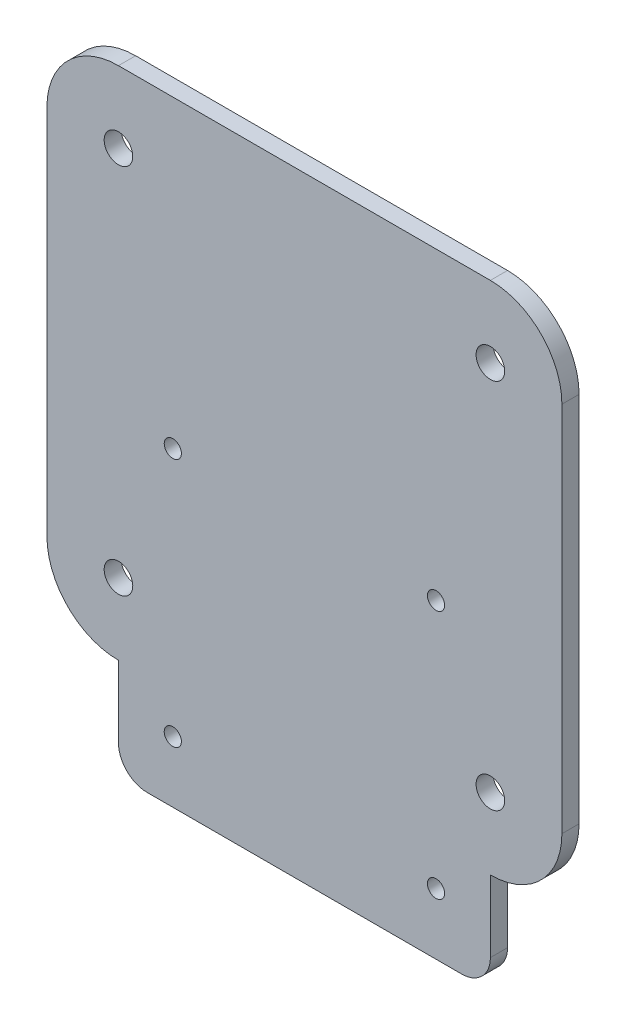
ISO-10303-21;
HEADER;
FILE_DESCRIPTION(('STEP AP214'),'2;1');
FILE_NAME('part.step','',(''),(''),'','','');
FILE_SCHEMA(('AUTOMOTIVE_DESIGN { 1 0 10303 214 1 1 1 1 }'));
ENDSEC;
DATA;
#1=APPLICATION_CONTEXT('core data for automotive mechanical design processes');
#2=APPLICATION_PROTOCOL_DEFINITION('international standard','automotive_design',2000,#1);
#3=PRODUCT_CONTEXT('',#1,'mechanical');
#4=PRODUCT('Part','Part','',(#3));
#5=PRODUCT_RELATED_PRODUCT_CATEGORY('part','',(#4));
#6=PRODUCT_DEFINITION_FORMATION('','',#4);
#7=PRODUCT_DEFINITION_CONTEXT('part definition',#1,'design');
#8=PRODUCT_DEFINITION('design','',#6,#7);
#9=PRODUCT_DEFINITION_SHAPE('','',#8);
#10=(LENGTH_UNIT() NAMED_UNIT(*) SI_UNIT(.MILLI.,.METRE.));
#11=(NAMED_UNIT(*) PLANE_ANGLE_UNIT() SI_UNIT($,.RADIAN.));
#12=(NAMED_UNIT(*) SI_UNIT($,.STERADIAN.) SOLID_ANGLE_UNIT());
#13=UNCERTAINTY_MEASURE_WITH_UNIT(LENGTH_MEASURE(1.E-05),#10,'distance_accuracy_value','');
#14=(GEOMETRIC_REPRESENTATION_CONTEXT(3) GLOBAL_UNCERTAINTY_ASSIGNED_CONTEXT((#13)) GLOBAL_UNIT_ASSIGNED_CONTEXT((#10,
#11,#12)) REPRESENTATION_CONTEXT('',''));
#15=CARTESIAN_POINT('',(0.,0.,0.));
#16=DIRECTION('',(0.,0.,1.));
#17=DIRECTION('',(1.,0.,0.));
#18=AXIS2_PLACEMENT_3D('',#15,#16,#17);
#19=CARTESIAN_POINT('',(27.5,-57.5,3.));
#20=DIRECTION('',(0.,0.,1.));
#21=DIRECTION('',(1.,0.,0.));
#22=AXIS2_PLACEMENT_3D('',#19,#20,#21);
#23=PLANE('',#22);
#24=CARTESIAN_POINT('',(32.4999999999999,-32.5,3.));
#25=DIRECTION('',(0.,0.,1.));
#26=DIRECTION('',(1.,0.,0.));
#27=AXIS2_PLACEMENT_3D('',#24,#25,#26);
#28=CIRCLE('',#27,2.5);
#29=CARTESIAN_POINT('',(34.9999999999999,-32.5,3.));
#30=VERTEX_POINT('',#29);
#31=EDGE_CURVE('E315',#30,#30,#28,.T.);
#32=ORIENTED_EDGE('',*,*,#31,.F.);
#33=EDGE_LOOP('',(#32));
#34=FACE_BOUND('',#33,.T.);
#35=CARTESIAN_POINT('',(-32.5,32.4999999999999,3.));
#36=DIRECTION('',(0.,0.,1.));
#37=DIRECTION('',(1.,0.,0.));
#38=AXIS2_PLACEMENT_3D('',#35,#36,#37);
#39=CIRCLE('',#38,2.5);
#40=CARTESIAN_POINT('',(-30.,32.4999999999999,3.));
#41=VERTEX_POINT('',#40);
#42=EDGE_CURVE('E327',#41,#41,#39,.T.);
#43=ORIENTED_EDGE('',*,*,#42,.F.);
#44=EDGE_LOOP('',(#43));
#45=FACE_BOUND('',#44,.T.);
#46=CARTESIAN_POINT('',(23.,-51.8,3.));
#47=DIRECTION('',(0.,0.,1.));
#48=DIRECTION('',(1.,0.,0.));
#49=AXIS2_PLACEMENT_3D('',#46,#47,#48);
#50=CIRCLE('',#49,1.5);
#51=CARTESIAN_POINT('',(24.5,-51.8,3.));
#52=VERTEX_POINT('',#51);
#53=EDGE_CURVE('E339',#52,#52,#50,.T.);
#54=ORIENTED_EDGE('',*,*,#53,.F.);
#55=EDGE_LOOP('',(#54));
#56=FACE_BOUND('',#55,.T.);
#57=CARTESIAN_POINT('',(-23.,-8.2,3.));
#58=DIRECTION('',(0.,0.,1.));
#59=DIRECTION('',(1.,0.,0.));
#60=AXIS2_PLACEMENT_3D('',#57,#58,#59);
#61=CIRCLE('',#60,1.5);
#62=CARTESIAN_POINT('',(-21.5,-8.2,3.));
#63=VERTEX_POINT('',#62);
#64=EDGE_CURVE('E166',#63,#63,#61,.T.);
#65=ORIENTED_EDGE('',*,*,#64,.F.);
#66=EDGE_LOOP('',(#65));
#67=FACE_BOUND('',#66,.T.);
#68=CARTESIAN_POINT('',(27.5,-57.5,3.));
#69=DIRECTION('',(0.,0.,1.));
#70=DIRECTION('',(1.,0.,0.));
#71=AXIS2_PLACEMENT_3D('',#68,#69,#70);
#72=CIRCLE('',#71,5.);
#73=CARTESIAN_POINT('',(27.5,-62.5,3.));
#74=VERTEX_POINT('',#73);
#75=CARTESIAN_POINT('',(32.5,-57.5,3.));
#76=VERTEX_POINT('',#75);
#77=EDGE_CURVE('E185',#74,#76,#72,.T.);
#78=ORIENTED_EDGE('',*,*,#77,.T.);
#79=DIRECTION('',(0.,1.,0.));
#80=VECTOR('',#79,1.);
#81=CARTESIAN_POINT('',(32.5,-45.,3.));
#82=LINE('',#81,#80);
#83=CARTESIAN_POINT('',(32.5,-45.,3.));
#84=VERTEX_POINT('',#83);
#85=EDGE_CURVE('E113',#76,#84,#82,.T.);
#86=ORIENTED_EDGE('',*,*,#85,.T.);
#87=CARTESIAN_POINT('',(32.5,-32.5,3.));
#88=DIRECTION('',(0.,0.,1.));
#89=DIRECTION('',(1.,0.,0.));
#90=AXIS2_PLACEMENT_3D('',#87,#88,#89);
#91=CIRCLE('',#90,12.5);
#92=CARTESIAN_POINT('',(45.,-32.5,3.));
#93=VERTEX_POINT('',#92);
#94=EDGE_CURVE('E212',#84,#93,#91,.T.);
#95=ORIENTED_EDGE('',*,*,#94,.T.);
#96=DIRECTION('',(0.,1.,0.));
#97=VECTOR('',#96,1.);
#98=CARTESIAN_POINT('',(45.,32.5,3.));
#99=LINE('',#98,#97);
#100=CARTESIAN_POINT('',(45.,32.5,3.));
#101=VERTEX_POINT('',#100);
#102=EDGE_CURVE('E231',#93,#101,#99,.T.);
#103=ORIENTED_EDGE('',*,*,#102,.T.);
#104=CARTESIAN_POINT('',(32.5,32.5,3.));
#105=DIRECTION('',(0.,0.,1.));
#106=DIRECTION('',(1.,0.,0.));
#107=AXIS2_PLACEMENT_3D('',#104,#105,#106);
#108=CIRCLE('',#107,12.5);
#109=CARTESIAN_POINT('',(32.5,45.,3.));
#110=VERTEX_POINT('',#109);
#111=EDGE_CURVE('E228',#101,#110,#108,.T.);
#112=ORIENTED_EDGE('',*,*,#111,.T.);
#113=DIRECTION('',(-1.,0.,0.));
#114=VECTOR('',#113,1.);
#115=CARTESIAN_POINT('',(-32.5,45.,3.));
#116=LINE('',#115,#114);
#117=CARTESIAN_POINT('',(-32.5,45.,3.));
#118=VERTEX_POINT('',#117);
#119=EDGE_CURVE('E230',#110,#118,#116,.T.);
#120=ORIENTED_EDGE('',*,*,#119,.T.);
#121=CARTESIAN_POINT('',(-32.5,32.5,3.));
#122=DIRECTION('',(0.,0.,1.));
#123=DIRECTION('',(1.,0.,0.));
#124=AXIS2_PLACEMENT_3D('',#121,#122,#123);
#125=CIRCLE('',#124,12.5);
#126=CARTESIAN_POINT('',(-45.,32.5,3.));
#127=VERTEX_POINT('',#126);
#128=EDGE_CURVE('E233',#118,#127,#125,.T.);
#129=ORIENTED_EDGE('',*,*,#128,.T.);
#130=DIRECTION('',(0.,-1.,0.));
#131=VECTOR('',#130,1.);
#132=CARTESIAN_POINT('',(-45.,32.5,3.));
#133=LINE('',#132,#131);
#134=CARTESIAN_POINT('',(-45.,-32.5,3.));
#135=VERTEX_POINT('',#134);
#136=EDGE_CURVE('E239',#127,#135,#133,.T.);
#137=ORIENTED_EDGE('',*,*,#136,.T.);
#138=CARTESIAN_POINT('',(-32.5,-32.5,3.));
#139=DIRECTION('',(0.,0.,1.));
#140=DIRECTION('',(-1.,0.,0.));
#141=AXIS2_PLACEMENT_3D('',#138,#139,#140);
#142=CIRCLE('',#141,12.5);
#143=CARTESIAN_POINT('',(-32.5,-45.,3.));
#144=VERTEX_POINT('',#143);
#145=EDGE_CURVE('E144',#135,#144,#142,.T.);
#146=ORIENTED_EDGE('',*,*,#145,.T.);
#147=DIRECTION('',(0.,-1.,0.));
#148=VECTOR('',#147,1.);
#149=CARTESIAN_POINT('',(-32.5,-45.,3.));
#150=LINE('',#149,#148);
#151=CARTESIAN_POINT('',(-32.5,-57.5,3.));
#152=VERTEX_POINT('',#151);
#153=EDGE_CURVE('E138',#144,#152,#150,.T.);
#154=ORIENTED_EDGE('',*,*,#153,.T.);
#155=CARTESIAN_POINT('',(-27.5,-57.5,3.));
#156=DIRECTION('',(0.,0.,1.));
#157=DIRECTION('',(-1.,0.,0.));
#158=AXIS2_PLACEMENT_3D('',#155,#156,#157);
#159=CIRCLE('',#158,5.);
#160=CARTESIAN_POINT('',(-27.5,-62.5,3.));
#161=VERTEX_POINT('',#160);
#162=EDGE_CURVE('E142',#152,#161,#159,.T.);
#163=ORIENTED_EDGE('',*,*,#162,.T.);
#164=DIRECTION('',(1.,0.,0.));
#165=VECTOR('',#164,1.);
#166=CARTESIAN_POINT('',(-27.5,-62.5,3.));
#167=LINE('',#166,#165);
#168=EDGE_CURVE('E58',#161,#74,#167,.T.);
#169=ORIENTED_EDGE('',*,*,#168,.T.);
#170=EDGE_LOOP('',(#78,#86,#95,#103,#112,#120,#129,#137,#146,#154,#163,#169));
#171=FACE_BOUND('',#170,.T.);
#172=CARTESIAN_POINT('',(23.,-8.2,3.));
#173=DIRECTION('',(0.,0.,1.));
#174=DIRECTION('',(1.,0.,0.));
#175=AXIS2_PLACEMENT_3D('',#172,#173,#174);
#176=CIRCLE('',#175,1.5);
#177=CARTESIAN_POINT('',(24.5,-8.2,3.));
#178=VERTEX_POINT('',#177);
#179=EDGE_CURVE('E345',#178,#178,#176,.T.);
#180=ORIENTED_EDGE('',*,*,#179,.F.);
#181=EDGE_LOOP('',(#180));
#182=FACE_BOUND('',#181,.T.);
#183=CARTESIAN_POINT('',(-23.,-51.8,3.));
#184=DIRECTION('',(0.,0.,1.));
#185=DIRECTION('',(1.,0.,0.));
#186=AXIS2_PLACEMENT_3D('',#183,#184,#185);
#187=CIRCLE('',#186,1.5);
#188=CARTESIAN_POINT('',(-21.5,-51.8,3.));
#189=VERTEX_POINT('',#188);
#190=EDGE_CURVE('E333',#189,#189,#187,.T.);
#191=ORIENTED_EDGE('',*,*,#190,.F.);
#192=EDGE_LOOP('',(#191));
#193=FACE_BOUND('',#192,.T.);
#194=CARTESIAN_POINT('',(32.4999999999999,32.4999999999999,3.));
#195=DIRECTION('',(0.,0.,1.));
#196=DIRECTION('',(1.,0.,0.));
#197=AXIS2_PLACEMENT_3D('',#194,#195,#196);
#198=CIRCLE('',#197,2.5);
#199=CARTESIAN_POINT('',(34.9999999999999,32.4999999999999,3.));
#200=VERTEX_POINT('',#199);
#201=EDGE_CURVE('E321',#200,#200,#198,.T.);
#202=ORIENTED_EDGE('',*,*,#201,.F.);
#203=EDGE_LOOP('',(#202));
#204=FACE_BOUND('',#203,.T.);
#205=CARTESIAN_POINT('',(-32.5,-32.5,3.));
#206=DIRECTION('',(0.,0.,1.));
#207=DIRECTION('',(1.,0.,0.));
#208=AXIS2_PLACEMENT_3D('',#205,#206,#207);
#209=CIRCLE('',#208,2.5);
#210=CARTESIAN_POINT('',(-30.,-32.5,3.));
#211=VERTEX_POINT('',#210);
#212=EDGE_CURVE('E306',#211,#211,#209,.T.);
#213=ORIENTED_EDGE('',*,*,#212,.F.);
#214=EDGE_LOOP('',(#213));
#215=FACE_BOUND('',#214,.T.);
#216=ADVANCED_FACE('F41',(#34,#45,#56,#67,#171,#182,#193,#204,#215),#23,.T.);
#217=CARTESIAN_POINT('',(27.5,-57.5,0.));
#218=DIRECTION('',(0.,0.,1.));
#219=DIRECTION('',(1.,0.,0.));
#220=AXIS2_PLACEMENT_3D('',#217,#218,#219);
#221=PLANE('',#220);
#222=CARTESIAN_POINT('',(27.5,-57.5,0.));
#223=DIRECTION('',(0.,0.,1.));
#224=DIRECTION('',(1.,0.,0.));
#225=AXIS2_PLACEMENT_3D('',#222,#223,#224);
#226=CIRCLE('',#225,5.);
#227=CARTESIAN_POINT('',(27.5,-62.5,0.));
#228=VERTEX_POINT('',#227);
#229=CARTESIAN_POINT('',(32.5,-57.5,0.));
#230=VERTEX_POINT('',#229);
#231=EDGE_CURVE('E162',#228,#230,#226,.T.);
#232=ORIENTED_EDGE('',*,*,#231,.F.);
#233=DIRECTION('',(1.,0.,0.));
#234=VECTOR('',#233,1.);
#235=CARTESIAN_POINT('',(-27.5,-62.5,0.));
#236=LINE('',#235,#234);
#237=CARTESIAN_POINT('',(-27.5,-62.5,0.));
#238=VERTEX_POINT('',#237);
#239=EDGE_CURVE('E105',#238,#228,#236,.T.);
#240=ORIENTED_EDGE('',*,*,#239,.F.);
#241=CARTESIAN_POINT('',(-27.5,-57.5,0.));
#242=DIRECTION('',(0.,0.,1.));
#243=DIRECTION('',(-1.,0.,0.));
#244=AXIS2_PLACEMENT_3D('',#241,#242,#243);
#245=CIRCLE('',#244,5.);
#246=CARTESIAN_POINT('',(-32.5,-57.5,0.));
#247=VERTEX_POINT('',#246);
#248=EDGE_CURVE('E99',#247,#238,#245,.T.);
#249=ORIENTED_EDGE('',*,*,#248,.F.);
#250=DIRECTION('',(0.,-1.,0.));
#251=VECTOR('',#250,1.);
#252=CARTESIAN_POINT('',(-32.5,-45.,0.));
#253=LINE('',#252,#251);
#254=CARTESIAN_POINT('',(-32.5,-45.,0.));
#255=VERTEX_POINT('',#254);
#256=EDGE_CURVE('E152',#255,#247,#253,.T.);
#257=ORIENTED_EDGE('',*,*,#256,.F.);
#258=CARTESIAN_POINT('',(-32.5,-32.5,0.));
#259=DIRECTION('',(0.,0.,1.));
#260=DIRECTION('',(-1.,0.,0.));
#261=AXIS2_PLACEMENT_3D('',#258,#259,#260);
#262=CIRCLE('',#261,12.5);
#263=CARTESIAN_POINT('',(-45.,-32.5,0.));
#264=VERTEX_POINT('',#263);
#265=EDGE_CURVE('E180',#264,#255,#262,.T.);
#266=ORIENTED_EDGE('',*,*,#265,.F.);
#267=DIRECTION('',(0.,-1.,0.));
#268=VECTOR('',#267,1.);
#269=CARTESIAN_POINT('',(-45.,32.5,0.));
#270=LINE('',#269,#268);
#271=CARTESIAN_POINT('',(-45.,32.5,0.));
#272=VERTEX_POINT('',#271);
#273=EDGE_CURVE('E178',#272,#264,#270,.T.);
#274=ORIENTED_EDGE('',*,*,#273,.F.);
#275=CARTESIAN_POINT('',(-32.5,32.5,0.));
#276=DIRECTION('',(0.,0.,1.));
#277=DIRECTION('',(1.,0.,0.));
#278=AXIS2_PLACEMENT_3D('',#275,#276,#277);
#279=CIRCLE('',#278,12.5);
#280=CARTESIAN_POINT('',(-32.5,45.,0.));
#281=VERTEX_POINT('',#280);
#282=EDGE_CURVE('E176',#281,#272,#279,.T.);
#283=ORIENTED_EDGE('',*,*,#282,.F.);
#284=DIRECTION('',(-1.,0.,0.));
#285=VECTOR('',#284,1.);
#286=CARTESIAN_POINT('',(-32.5,45.,0.));
#287=LINE('',#286,#285);
#288=CARTESIAN_POINT('',(32.5,45.,0.));
#289=VERTEX_POINT('',#288);
#290=EDGE_CURVE('E174',#289,#281,#287,.T.);
#291=ORIENTED_EDGE('',*,*,#290,.F.);
#292=CARTESIAN_POINT('',(32.5,32.5,0.));
#293=DIRECTION('',(0.,0.,1.));
#294=DIRECTION('',(1.,0.,0.));
#295=AXIS2_PLACEMENT_3D('',#292,#293,#294);
#296=CIRCLE('',#295,12.5);
#297=CARTESIAN_POINT('',(45.,32.5,0.));
#298=VERTEX_POINT('',#297);
#299=EDGE_CURVE('E172',#298,#289,#296,.T.);
#300=ORIENTED_EDGE('',*,*,#299,.F.);
#301=DIRECTION('',(0.,1.,0.));
#302=VECTOR('',#301,1.);
#303=CARTESIAN_POINT('',(45.,32.5,0.));
#304=LINE('',#303,#302);
#305=CARTESIAN_POINT('',(45.,-32.5,0.));
#306=VERTEX_POINT('',#305);
#307=EDGE_CURVE('E170',#306,#298,#304,.T.);
#308=ORIENTED_EDGE('',*,*,#307,.F.);
#309=CARTESIAN_POINT('',(32.5,-32.5,0.));
#310=DIRECTION('',(0.,0.,1.));
#311=DIRECTION('',(1.,0.,0.));
#312=AXIS2_PLACEMENT_3D('',#309,#310,#311);
#313=CIRCLE('',#312,12.5);
#314=CARTESIAN_POINT('',(32.5,-45.,0.));
#315=VERTEX_POINT('',#314);
#316=EDGE_CURVE('E168',#315,#306,#313,.T.);
#317=ORIENTED_EDGE('',*,*,#316,.F.);
#318=DIRECTION('',(0.,1.,0.));
#319=VECTOR('',#318,1.);
#320=CARTESIAN_POINT('',(32.5,-45.,0.));
#321=LINE('',#320,#319);
#322=EDGE_CURVE('E165',#230,#315,#321,.T.);
#323=ORIENTED_EDGE('',*,*,#322,.F.);
#324=EDGE_LOOP('',(#232,#240,#249,#257,#266,#274,#283,#291,#300,#308,#317,#323));
#325=FACE_BOUND('',#324,.T.);
#326=CARTESIAN_POINT('',(-23.,-8.2,0.));
#327=DIRECTION('',(0.,0.,1.));
#328=DIRECTION('',(1.,0.,0.));
#329=AXIS2_PLACEMENT_3D('',#326,#327,#328);
#330=CIRCLE('',#329,1.5);
#331=CARTESIAN_POINT('',(-21.5,-8.2,0.));
#332=VERTEX_POINT('',#331);
#333=EDGE_CURVE('E348',#332,#332,#330,.T.);
#334=ORIENTED_EDGE('',*,*,#333,.T.);
#335=EDGE_LOOP('',(#334));
#336=FACE_BOUND('',#335,.T.);
#337=CARTESIAN_POINT('',(23.,-8.2,0.));
#338=DIRECTION('',(0.,0.,1.));
#339=DIRECTION('',(1.,0.,0.));
#340=AXIS2_PLACEMENT_3D('',#337,#338,#339);
#341=CIRCLE('',#340,1.5);
#342=CARTESIAN_POINT('',(24.5,-8.2,0.));
#343=VERTEX_POINT('',#342);
#344=EDGE_CURVE('E342',#343,#343,#341,.T.);
#345=ORIENTED_EDGE('',*,*,#344,.T.);
#346=EDGE_LOOP('',(#345));
#347=FACE_BOUND('',#346,.T.);
#348=CARTESIAN_POINT('',(23.,-51.8,0.));
#349=DIRECTION('',(0.,0.,1.));
#350=DIRECTION('',(1.,0.,0.));
#351=AXIS2_PLACEMENT_3D('',#348,#349,#350);
#352=CIRCLE('',#351,1.5);
#353=CARTESIAN_POINT('',(24.5,-51.8,0.));
#354=VERTEX_POINT('',#353);
#355=EDGE_CURVE('E336',#354,#354,#352,.T.);
#356=ORIENTED_EDGE('',*,*,#355,.T.);
#357=EDGE_LOOP('',(#356));
#358=FACE_BOUND('',#357,.T.);
#359=CARTESIAN_POINT('',(-23.,-51.8,0.));
#360=DIRECTION('',(0.,0.,1.));
#361=DIRECTION('',(1.,0.,0.));
#362=AXIS2_PLACEMENT_3D('',#359,#360,#361);
#363=CIRCLE('',#362,1.5);
#364=CARTESIAN_POINT('',(-21.5,-51.8,0.));
#365=VERTEX_POINT('',#364);
#366=EDGE_CURVE('E330',#365,#365,#363,.T.);
#367=ORIENTED_EDGE('',*,*,#366,.T.);
#368=EDGE_LOOP('',(#367));
#369=FACE_BOUND('',#368,.T.);
#370=CARTESIAN_POINT('',(-32.5,32.4999999999999,0.));
#371=DIRECTION('',(0.,0.,1.));
#372=DIRECTION('',(1.,0.,0.));
#373=AXIS2_PLACEMENT_3D('',#370,#371,#372);
#374=CIRCLE('',#373,2.5);
#375=CARTESIAN_POINT('',(-30.,32.4999999999999,0.));
#376=VERTEX_POINT('',#375);
#377=EDGE_CURVE('E324',#376,#376,#374,.T.);
#378=ORIENTED_EDGE('',*,*,#377,.T.);
#379=EDGE_LOOP('',(#378));
#380=FACE_BOUND('',#379,.T.);
#381=CARTESIAN_POINT('',(32.4999999999999,32.4999999999999,0.));
#382=DIRECTION('',(0.,0.,1.));
#383=DIRECTION('',(1.,0.,0.));
#384=AXIS2_PLACEMENT_3D('',#381,#382,#383);
#385=CIRCLE('',#384,2.5);
#386=CARTESIAN_POINT('',(34.9999999999999,32.4999999999999,0.));
#387=VERTEX_POINT('',#386);
#388=EDGE_CURVE('E318',#387,#387,#385,.T.);
#389=ORIENTED_EDGE('',*,*,#388,.T.);
#390=EDGE_LOOP('',(#389));
#391=FACE_BOUND('',#390,.T.);
#392=CARTESIAN_POINT('',(32.4999999999999,-32.5,0.));
#393=DIRECTION('',(0.,0.,1.));
#394=DIRECTION('',(1.,0.,0.));
#395=AXIS2_PLACEMENT_3D('',#392,#393,#394);
#396=CIRCLE('',#395,2.5);
#397=CARTESIAN_POINT('',(34.9999999999999,-32.5,0.));
#398=VERTEX_POINT('',#397);
#399=EDGE_CURVE('E312',#398,#398,#396,.T.);
#400=ORIENTED_EDGE('',*,*,#399,.T.);
#401=EDGE_LOOP('',(#400));
#402=FACE_BOUND('',#401,.T.);
#403=CARTESIAN_POINT('',(-32.5,-32.5,0.));
#404=DIRECTION('',(0.,0.,1.));
#405=DIRECTION('',(1.,0.,0.));
#406=AXIS2_PLACEMENT_3D('',#403,#404,#405);
#407=CIRCLE('',#406,2.5);
#408=CARTESIAN_POINT('',(-30.,-32.5,0.));
#409=VERTEX_POINT('',#408);
#410=EDGE_CURVE('E309',#409,#409,#407,.T.);
#411=ORIENTED_EDGE('',*,*,#410,.T.);
#412=EDGE_LOOP('',(#411));
#413=FACE_BOUND('',#412,.T.);
#414=ADVANCED_FACE('F216',(#325,#336,#347,#358,#369,#380,#391,#402,#413),#221,.F.);
#415=CARTESIAN_POINT('',(27.5,-57.5,3.));
#416=DIRECTION('',(0.,0.,-1.));
#417=DIRECTION('',(-1.,0.,0.));
#418=AXIS2_PLACEMENT_3D('',#415,#416,#417);
#419=CYLINDRICAL_SURFACE('',#418,5.);
#420=ORIENTED_EDGE('',*,*,#231,.T.);
#421=DIRECTION('',(0.,0.,-1.));
#422=VECTOR('',#421,1.);
#423=CARTESIAN_POINT('',(32.5,-57.5,3.));
#424=LINE('',#423,#422);
#425=EDGE_CURVE('E11',#76,#230,#424,.T.);
#426=ORIENTED_EDGE('',*,*,#425,.F.);
#427=ORIENTED_EDGE('',*,*,#77,.F.);
#428=DIRECTION('',(0.,0.,-1.));
#429=VECTOR('',#428,1.);
#430=CARTESIAN_POINT('',(27.5,-62.5,3.));
#431=LINE('',#430,#429);
#432=EDGE_CURVE('E158',#74,#228,#431,.T.);
#433=ORIENTED_EDGE('',*,*,#432,.T.);
#434=EDGE_LOOP('',(#420,#426,#427,#433));
#435=FACE_BOUND('',#434,.T.);
#436=ADVANCED_FACE('F43',(#435),#419,.T.);
#437=CARTESIAN_POINT('',(32.5,-45.,3.));
#438=DIRECTION('',(-1.,0.,0.));
#439=DIRECTION('',(0.,0.,1.));
#440=AXIS2_PLACEMENT_3D('',#437,#438,#439);
#441=PLANE('',#440);
#442=ORIENTED_EDGE('',*,*,#322,.T.);
#443=DIRECTION('',(0.,0.,-1.));
#444=VECTOR('',#443,1.);
#445=CARTESIAN_POINT('',(32.5,-45.,3.));
#446=LINE('',#445,#444);
#447=EDGE_CURVE('E50',#84,#315,#446,.T.);
#448=ORIENTED_EDGE('',*,*,#447,.F.);
#449=ORIENTED_EDGE('',*,*,#85,.F.);
#450=ORIENTED_EDGE('',*,*,#425,.T.);
#451=EDGE_LOOP('',(#442,#448,#449,#450));
#452=FACE_BOUND('',#451,.T.);
#453=ADVANCED_FACE('F502',(#452),#441,.F.);
#454=CARTESIAN_POINT('',(32.5,-32.5,3.));
#455=DIRECTION('',(0.,0.,-1.));
#456=DIRECTION('',(-1.,0.,0.));
#457=AXIS2_PLACEMENT_3D('',#454,#455,#456);
#458=CYLINDRICAL_SURFACE('',#457,12.5);
#459=ORIENTED_EDGE('',*,*,#316,.T.);
#460=DIRECTION('',(0.,0.,-1.));
#461=VECTOR('',#460,1.);
#462=CARTESIAN_POINT('',(45.,-32.5,3.));
#463=LINE('',#462,#461);
#464=EDGE_CURVE('E204',#93,#306,#463,.T.);
#465=ORIENTED_EDGE('',*,*,#464,.F.);
#466=ORIENTED_EDGE('',*,*,#94,.F.);
#467=ORIENTED_EDGE('',*,*,#447,.T.);
#468=EDGE_LOOP('',(#459,#465,#466,#467));
#469=FACE_BOUND('',#468,.T.);
#470=ADVANCED_FACE('F210',(#469),#458,.T.);
#471=CARTESIAN_POINT('',(45.,32.5,3.));
#472=DIRECTION('',(-1.,0.,0.));
#473=DIRECTION('',(0.,0.,1.));
#474=AXIS2_PLACEMENT_3D('',#471,#472,#473);
#475=PLANE('',#474);
#476=ORIENTED_EDGE('',*,*,#307,.T.);
#477=DIRECTION('',(0.,0.,-1.));
#478=VECTOR('',#477,1.);
#479=CARTESIAN_POINT('',(45.,32.5,3.));
#480=LINE('',#479,#478);
#481=EDGE_CURVE('E201',#101,#298,#480,.T.);
#482=ORIENTED_EDGE('',*,*,#481,.F.);
#483=ORIENTED_EDGE('',*,*,#102,.F.);
#484=ORIENTED_EDGE('',*,*,#464,.T.);
#485=EDGE_LOOP('',(#476,#482,#483,#484));
#486=FACE_BOUND('',#485,.T.);
#487=ADVANCED_FACE('F222',(#486),#475,.F.);
#488=CARTESIAN_POINT('',(32.5,32.5,3.));
#489=DIRECTION('',(0.,0.,-1.));
#490=DIRECTION('',(-1.,0.,0.));
#491=AXIS2_PLACEMENT_3D('',#488,#489,#490);
#492=CYLINDRICAL_SURFACE('',#491,12.5);
#493=ORIENTED_EDGE('',*,*,#299,.T.);
#494=DIRECTION('',(0.,0.,-1.));
#495=VECTOR('',#494,1.);
#496=CARTESIAN_POINT('',(32.5,45.,3.));
#497=LINE('',#496,#495);
#498=EDGE_CURVE('E198',#110,#289,#497,.T.);
#499=ORIENTED_EDGE('',*,*,#498,.F.);
#500=ORIENTED_EDGE('',*,*,#111,.F.);
#501=ORIENTED_EDGE('',*,*,#481,.T.);
#502=EDGE_LOOP('',(#493,#499,#500,#501));
#503=FACE_BOUND('',#502,.T.);
#504=ADVANCED_FACE('F226',(#503),#492,.T.);
#505=CARTESIAN_POINT('',(-32.5,45.,3.));
#506=DIRECTION('',(0.,-1.,0.));
#507=DIRECTION('',(0.,0.,-1.));
#508=AXIS2_PLACEMENT_3D('',#505,#506,#507);
#509=PLANE('',#508);
#510=ORIENTED_EDGE('',*,*,#290,.T.);
#511=DIRECTION('',(0.,0.,-1.));
#512=VECTOR('',#511,1.);
#513=CARTESIAN_POINT('',(-32.5,45.,3.));
#514=LINE('',#513,#512);
#515=EDGE_CURVE('E195',#118,#281,#514,.T.);
#516=ORIENTED_EDGE('',*,*,#515,.F.);
#517=ORIENTED_EDGE('',*,*,#119,.F.);
#518=ORIENTED_EDGE('',*,*,#498,.T.);
#519=EDGE_LOOP('',(#510,#516,#517,#518));
#520=FACE_BOUND('',#519,.T.);
#521=ADVANCED_FACE('F467',(#520),#509,.F.);
#522=CARTESIAN_POINT('',(-32.5,32.5,3.));
#523=DIRECTION('',(0.,0.,-1.));
#524=DIRECTION('',(-1.,0.,0.));
#525=AXIS2_PLACEMENT_3D('',#522,#523,#524);
#526=CYLINDRICAL_SURFACE('',#525,12.5);
#527=ORIENTED_EDGE('',*,*,#282,.T.);
#528=DIRECTION('',(0.,0.,-1.));
#529=VECTOR('',#528,1.);
#530=CARTESIAN_POINT('',(-45.,32.5,3.));
#531=LINE('',#530,#529);
#532=EDGE_CURVE('E192',#127,#272,#531,.T.);
#533=ORIENTED_EDGE('',*,*,#532,.F.);
#534=ORIENTED_EDGE('',*,*,#128,.F.);
#535=ORIENTED_EDGE('',*,*,#515,.T.);
#536=EDGE_LOOP('',(#527,#533,#534,#535));
#537=FACE_BOUND('',#536,.T.);
#538=ADVANCED_FACE('F458',(#537),#526,.T.);
#539=CARTESIAN_POINT('',(-45.,32.5,3.));
#540=DIRECTION('',(1.,0.,0.));
#541=DIRECTION('',(0.,0.,-1.));
#542=AXIS2_PLACEMENT_3D('',#539,#540,#541);
#543=PLANE('',#542);
#544=ORIENTED_EDGE('',*,*,#273,.T.);
#545=DIRECTION('',(0.,0.,-1.));
#546=VECTOR('',#545,1.);
#547=CARTESIAN_POINT('',(-45.,-32.5,3.));
#548=LINE('',#547,#546);
#549=EDGE_CURVE('E189',#135,#264,#548,.T.);
#550=ORIENTED_EDGE('',*,*,#549,.F.);
#551=ORIENTED_EDGE('',*,*,#136,.F.);
#552=ORIENTED_EDGE('',*,*,#532,.T.);
#553=EDGE_LOOP('',(#544,#550,#551,#552));
#554=FACE_BOUND('',#553,.T.);
#555=ADVANCED_FACE('F245',(#554),#543,.F.);
#556=CARTESIAN_POINT('',(-32.5,-32.5,3.));
#557=DIRECTION('',(0.,0.,-1.));
#558=DIRECTION('',(-1.,0.,0.));
#559=AXIS2_PLACEMENT_3D('',#556,#557,#558);
#560=CYLINDRICAL_SURFACE('',#559,12.5);
#561=ORIENTED_EDGE('',*,*,#265,.T.);
#562=DIRECTION('',(0.,0.,-1.));
#563=VECTOR('',#562,1.);
#564=CARTESIAN_POINT('',(-32.5,-45.,3.));
#565=LINE('',#564,#563);
#566=EDGE_CURVE('E153',#144,#255,#565,.T.);
#567=ORIENTED_EDGE('',*,*,#566,.F.);
#568=ORIENTED_EDGE('',*,*,#145,.F.);
#569=ORIENTED_EDGE('',*,*,#549,.T.);
#570=EDGE_LOOP('',(#561,#567,#568,#569));
#571=FACE_BOUND('',#570,.T.);
#572=ADVANCED_FACE('F249',(#571),#560,.T.);
#573=CARTESIAN_POINT('',(-32.5,-45.,3.));
#574=DIRECTION('',(1.,0.,0.));
#575=DIRECTION('',(0.,0.,-1.));
#576=AXIS2_PLACEMENT_3D('',#573,#574,#575);
#577=PLANE('',#576);
#578=ORIENTED_EDGE('',*,*,#256,.T.);
#579=DIRECTION('',(0.,0.,-1.));
#580=VECTOR('',#579,1.);
#581=CARTESIAN_POINT('',(-32.5,-57.5,3.));
#582=LINE('',#581,#580);
#583=EDGE_CURVE('E149',#152,#247,#582,.T.);
#584=ORIENTED_EDGE('',*,*,#583,.F.);
#585=ORIENTED_EDGE('',*,*,#153,.F.);
#586=ORIENTED_EDGE('',*,*,#566,.T.);
#587=EDGE_LOOP('',(#578,#584,#585,#586));
#588=FACE_BOUND('',#587,.T.);
#589=ADVANCED_FACE('F150',(#588),#577,.F.);
#590=CARTESIAN_POINT('',(-27.5,-57.5,3.));
#591=DIRECTION('',(0.,0.,-1.));
#592=DIRECTION('',(-1.,0.,0.));
#593=AXIS2_PLACEMENT_3D('',#590,#591,#592);
#594=CYLINDRICAL_SURFACE('',#593,5.);
#595=ORIENTED_EDGE('',*,*,#248,.T.);
#596=DIRECTION('',(0.,0.,-1.));
#597=VECTOR('',#596,1.);
#598=CARTESIAN_POINT('',(-27.5,-62.5,3.));
#599=LINE('',#598,#597);
#600=EDGE_CURVE('E154',#161,#238,#599,.T.);
#601=ORIENTED_EDGE('',*,*,#600,.F.);
#602=ORIENTED_EDGE('',*,*,#162,.F.);
#603=ORIENTED_EDGE('',*,*,#583,.T.);
#604=EDGE_LOOP('',(#595,#601,#602,#603));
#605=FACE_BOUND('',#604,.T.);
#606=ADVANCED_FACE('F156',(#605),#594,.T.);
#607=CARTESIAN_POINT('',(-27.5,-62.5,3.));
#608=DIRECTION('',(0.,1.,0.));
#609=DIRECTION('',(-1.,0.,0.));
#610=AXIS2_PLACEMENT_3D('',#607,#608,#609);
#611=PLANE('',#610);
#612=ORIENTED_EDGE('',*,*,#239,.T.);
#613=ORIENTED_EDGE('',*,*,#432,.F.);
#614=ORIENTED_EDGE('',*,*,#168,.F.);
#615=ORIENTED_EDGE('',*,*,#600,.T.);
#616=EDGE_LOOP('',(#612,#613,#614,#615));
#617=FACE_BOUND('',#616,.T.);
#618=ADVANCED_FACE('F253',(#617),#611,.F.);
#619=CARTESIAN_POINT('',(-23.,-8.2,3.));
#620=DIRECTION('',(0.,0.,-1.));
#621=DIRECTION('',(-1.,0.,0.));
#622=AXIS2_PLACEMENT_3D('',#619,#620,#621);
#623=CYLINDRICAL_SURFACE('',#622,1.5);
#624=ORIENTED_EDGE('',*,*,#64,.T.);
#625=EDGE_LOOP('',(#624));
#626=FACE_BOUND('',#625,.T.);
#627=ORIENTED_EDGE('',*,*,#333,.F.);
#628=EDGE_LOOP('',(#627));
#629=FACE_BOUND('',#628,.T.);
#630=ADVANCED_FACE('F255',(#626,#629),#623,.F.);
#631=CARTESIAN_POINT('',(23.,-8.2,3.));
#632=DIRECTION('',(0.,0.,-1.));
#633=DIRECTION('',(-1.,0.,0.));
#634=AXIS2_PLACEMENT_3D('',#631,#632,#633);
#635=CYLINDRICAL_SURFACE('',#634,1.5);
#636=ORIENTED_EDGE('',*,*,#179,.T.);
#637=EDGE_LOOP('',(#636));
#638=FACE_BOUND('',#637,.T.);
#639=ORIENTED_EDGE('',*,*,#344,.F.);
#640=EDGE_LOOP('',(#639));
#641=FACE_BOUND('',#640,.T.);
#642=ADVANCED_FACE('F261',(#638,#641),#635,.F.);
#643=CARTESIAN_POINT('',(23.,-51.8,3.));
#644=DIRECTION('',(0.,0.,-1.));
#645=DIRECTION('',(-1.,0.,0.));
#646=AXIS2_PLACEMENT_3D('',#643,#644,#645);
#647=CYLINDRICAL_SURFACE('',#646,1.5);
#648=ORIENTED_EDGE('',*,*,#53,.T.);
#649=EDGE_LOOP('',(#648));
#650=FACE_BOUND('',#649,.T.);
#651=ORIENTED_EDGE('',*,*,#355,.F.);
#652=EDGE_LOOP('',(#651));
#653=FACE_BOUND('',#652,.T.);
#654=ADVANCED_FACE('F277',(#650,#653),#647,.F.);
#655=CARTESIAN_POINT('',(-23.,-51.8,3.));
#656=DIRECTION('',(0.,0.,-1.));
#657=DIRECTION('',(-1.,0.,0.));
#658=AXIS2_PLACEMENT_3D('',#655,#656,#657);
#659=CYLINDRICAL_SURFACE('',#658,1.5);
#660=ORIENTED_EDGE('',*,*,#190,.T.);
#661=EDGE_LOOP('',(#660));
#662=FACE_BOUND('',#661,.T.);
#663=ORIENTED_EDGE('',*,*,#366,.F.);
#664=EDGE_LOOP('',(#663));
#665=FACE_BOUND('',#664,.T.);
#666=ADVANCED_FACE('F281',(#662,#665),#659,.F.);
#667=CARTESIAN_POINT('',(-32.5,32.4999999999999,3.));
#668=DIRECTION('',(0.,0.,-1.));
#669=DIRECTION('',(-1.,0.,0.));
#670=AXIS2_PLACEMENT_3D('',#667,#668,#669);
#671=CYLINDRICAL_SURFACE('',#670,2.5);
#672=ORIENTED_EDGE('',*,*,#42,.T.);
#673=EDGE_LOOP('',(#672));
#674=FACE_BOUND('',#673,.T.);
#675=ORIENTED_EDGE('',*,*,#377,.F.);
#676=EDGE_LOOP('',(#675));
#677=FACE_BOUND('',#676,.T.);
#678=ADVANCED_FACE('F285',(#674,#677),#671,.F.);
#679=CARTESIAN_POINT('',(32.4999999999999,32.4999999999999,3.));
#680=DIRECTION('',(0.,0.,-1.));
#681=DIRECTION('',(-1.,0.,0.));
#682=AXIS2_PLACEMENT_3D('',#679,#680,#681);
#683=CYLINDRICAL_SURFACE('',#682,2.5);
#684=ORIENTED_EDGE('',*,*,#201,.T.);
#685=EDGE_LOOP('',(#684));
#686=FACE_BOUND('',#685,.T.);
#687=ORIENTED_EDGE('',*,*,#388,.F.);
#688=EDGE_LOOP('',(#687));
#689=FACE_BOUND('',#688,.T.);
#690=ADVANCED_FACE('F289',(#686,#689),#683,.F.);
#691=CARTESIAN_POINT('',(32.4999999999999,-32.5,3.));
#692=DIRECTION('',(0.,0.,-1.));
#693=DIRECTION('',(-1.,0.,0.));
#694=AXIS2_PLACEMENT_3D('',#691,#692,#693);
#695=CYLINDRICAL_SURFACE('',#694,2.5);
#696=ORIENTED_EDGE('',*,*,#31,.T.);
#697=EDGE_LOOP('',(#696));
#698=FACE_BOUND('',#697,.T.);
#699=ORIENTED_EDGE('',*,*,#399,.F.);
#700=EDGE_LOOP('',(#699));
#701=FACE_BOUND('',#700,.T.);
#702=ADVANCED_FACE('F293',(#698,#701),#695,.F.);
#703=CARTESIAN_POINT('',(-32.5,-32.5,3.));
#704=DIRECTION('',(0.,0.,-1.));
#705=DIRECTION('',(-1.,0.,0.));
#706=AXIS2_PLACEMENT_3D('',#703,#704,#705);
#707=CYLINDRICAL_SURFACE('',#706,2.5);
#708=ORIENTED_EDGE('',*,*,#212,.T.);
#709=EDGE_LOOP('',(#708));
#710=FACE_BOUND('',#709,.T.);
#711=ORIENTED_EDGE('',*,*,#410,.F.);
#712=EDGE_LOOP('',(#711));
#713=FACE_BOUND('',#712,.T.);
#714=ADVANCED_FACE('F297',(#710,#713),#707,.F.);
#715=CLOSED_SHELL('',(#216,#414,#436,#453,#470,#487,#504,#521,#538,#555,#572,#589,#606,#618,
#630,#642,#654,#666,#678,#690,#702,#714));
#716=MANIFOLD_SOLID_BREP('B2',#715);
#717=ADVANCED_BREP_SHAPE_REPRESENTATION('',(#18,#716),#14);
#718=SHAPE_DEFINITION_REPRESENTATION(#9,#717);
ENDSEC;
END-ISO-10303-21;
